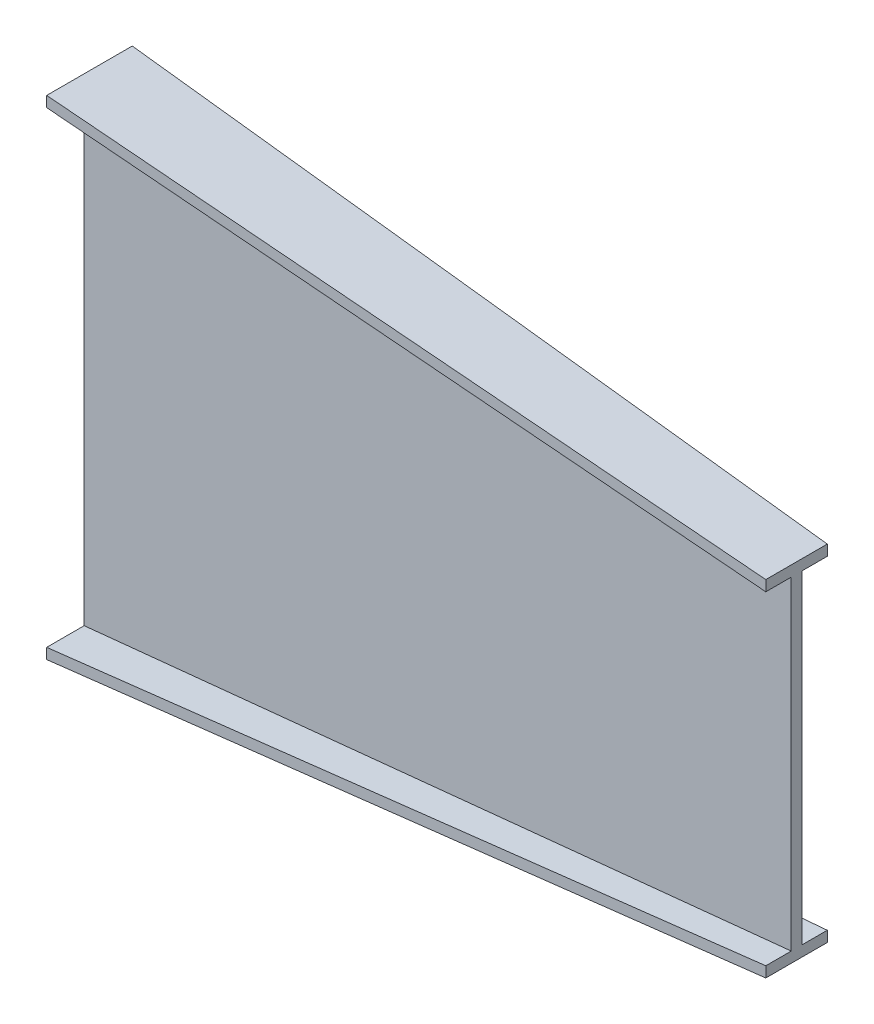
ISO-10303-21;
HEADER;
FILE_DESCRIPTION(('STEP AP214'),'2;1');
FILE_NAME('part.step','',(''),(''),'','','');
FILE_SCHEMA(('AUTOMOTIVE_DESIGN { 1 0 10303 214 1 1 1 1 }'));
ENDSEC;
DATA;
#1=APPLICATION_CONTEXT('core data for automotive mechanical design processes');
#2=APPLICATION_PROTOCOL_DEFINITION('international standard','automotive_design',2000,#1);
#3=PRODUCT_CONTEXT('',#1,'mechanical');
#4=PRODUCT('Part','Part','',(#3));
#5=PRODUCT_RELATED_PRODUCT_CATEGORY('part','',(#4));
#6=PRODUCT_DEFINITION_FORMATION('','',#4);
#7=PRODUCT_DEFINITION_CONTEXT('part definition',#1,'design');
#8=PRODUCT_DEFINITION('design','',#6,#7);
#9=PRODUCT_DEFINITION_SHAPE('','',#8);
#10=(LENGTH_UNIT() NAMED_UNIT(*) SI_UNIT(.MILLI.,.METRE.));
#11=(NAMED_UNIT(*) PLANE_ANGLE_UNIT() SI_UNIT($,.RADIAN.));
#12=(NAMED_UNIT(*) SI_UNIT($,.STERADIAN.) SOLID_ANGLE_UNIT());
#13=UNCERTAINTY_MEASURE_WITH_UNIT(LENGTH_MEASURE(1.E-05),#10,'distance_accuracy_value','');
#14=(GEOMETRIC_REPRESENTATION_CONTEXT(3) GLOBAL_UNCERTAINTY_ASSIGNED_CONTEXT((#13)) GLOBAL_UNIT_ASSIGNED_CONTEXT((#10,
#11,#12)) REPRESENTATION_CONTEXT('',''));
#15=CARTESIAN_POINT('',(0.,0.,0.));
#16=DIRECTION('',(0.,0.,1.));
#17=DIRECTION('',(1.,0.,0.));
#18=AXIS2_PLACEMENT_3D('',#15,#16,#17);
#19=CARTESIAN_POINT('',(1000.,0.,0.));
#20=DIRECTION('',(-1.,0.,0.));
#21=DIRECTION('',(0.,0.,1.));
#22=AXIS2_PLACEMENT_3D('',#19,#20,#21);
#23=PLANE('',#22);
#24=DIRECTION('',(0.,-1.,0.));
#25=VECTOR('',#24,1.);
#26=CARTESIAN_POINT('',(1000.,244.,-35.9999999999997));
#27=LINE('',#26,#25);
#28=CARTESIAN_POINT('',(1000.,244.,-35.9999999999997));
#29=VERTEX_POINT('',#28);
#30=CARTESIAN_POINT('',(1000.,229.,-35.9999999999997));
#31=VERTEX_POINT('',#30);
#32=EDGE_CURVE('E375',#29,#31,#27,.T.);
#33=ORIENTED_EDGE('',*,*,#32,.F.);
#34=DIRECTION('',(0.,0.,-1.));
#35=VECTOR('',#34,1.);
#36=CARTESIAN_POINT('',(1000.,244.,-35.9999999999997));
#37=LINE('',#36,#35);
#38=CARTESIAN_POINT('',(1000.,244.,51.0000000000004));
#39=VERTEX_POINT('',#38);
#40=EDGE_CURVE('E12',#39,#29,#37,.T.);
#41=ORIENTED_EDGE('',*,*,#40,.F.);
#42=DIRECTION('',(0.,1.,0.));
#43=VECTOR('',#42,1.);
#44=CARTESIAN_POINT('',(1000.,244.,51.0000000000004));
#45=LINE('',#44,#43);
#46=CARTESIAN_POINT('',(1000.,229.,51.0000000000004));
#47=VERTEX_POINT('',#46);
#48=EDGE_CURVE('E69',#47,#39,#45,.T.);
#49=ORIENTED_EDGE('',*,*,#48,.F.);
#50=DIRECTION('',(0.,0.,1.));
#51=VECTOR('',#50,1.);
#52=CARTESIAN_POINT('',(1000.,229.,15.0000000000003));
#53=LINE('',#52,#51);
#54=CARTESIAN_POINT('',(1000.,229.,15.0000000000003));
#55=VERTEX_POINT('',#54);
#56=EDGE_CURVE('E650',#55,#47,#53,.T.);
#57=ORIENTED_EDGE('',*,*,#56,.F.);
#58=DIRECTION('',(0.,1.,0.));
#59=VECTOR('',#58,1.);
#60=CARTESIAN_POINT('',(1000.,229.,15.0000000000003));
#61=LINE('',#60,#59);
#62=CARTESIAN_POINT('',(1000.,-229.,15.0000000000003));
#63=VERTEX_POINT('',#62);
#64=EDGE_CURVE('E412',#63,#55,#61,.T.);
#65=ORIENTED_EDGE('',*,*,#64,.F.);
#66=DIRECTION('',(0.,0.,-1.));
#67=VECTOR('',#66,1.);
#68=CARTESIAN_POINT('',(1000.,-229.,15.0000000000003));
#69=LINE('',#68,#67);
#70=CARTESIAN_POINT('',(1000.,-229.,51.0000000000002));
#71=VERTEX_POINT('',#70);
#72=EDGE_CURVE('E426',#71,#63,#69,.T.);
#73=ORIENTED_EDGE('',*,*,#72,.F.);
#74=DIRECTION('',(0.,1.,0.));
#75=VECTOR('',#74,1.);
#76=CARTESIAN_POINT('',(1000.,-229.,51.0000000000002));
#77=LINE('',#76,#75);
#78=CARTESIAN_POINT('',(1000.,-244.,51.0000000000004));
#79=VERTEX_POINT('',#78);
#80=EDGE_CURVE('E440',#79,#71,#77,.T.);
#81=ORIENTED_EDGE('',*,*,#80,.F.);
#82=DIRECTION('',(0.,0.,1.));
#83=VECTOR('',#82,1.);
#84=CARTESIAN_POINT('',(1000.,-244.,-35.9999999999997));
#85=LINE('',#84,#83);
#86=CARTESIAN_POINT('',(1000.,-244.,-35.9999999999997));
#87=VERTEX_POINT('',#86);
#88=EDGE_CURVE('E621',#87,#79,#85,.T.);
#89=ORIENTED_EDGE('',*,*,#88,.F.);
#90=DIRECTION('',(0.,-1.,0.));
#91=VECTOR('',#90,1.);
#92=CARTESIAN_POINT('',(1000.,-229.,-35.9999999999997));
#93=LINE('',#92,#91);
#94=CARTESIAN_POINT('',(1000.,-229.,-35.9999999999997));
#95=VERTEX_POINT('',#94);
#96=EDGE_CURVE('E613',#95,#87,#93,.T.);
#97=ORIENTED_EDGE('',*,*,#96,.F.);
#98=DIRECTION('',(0.,0.,-1.));
#99=VECTOR('',#98,1.);
#100=CARTESIAN_POINT('',(1000.,-229.,-35.9999999999997));
#101=LINE('',#100,#99);
#102=CARTESIAN_POINT('',(1000.,-229.,4.44089209850063E-13));
#103=VERTEX_POINT('',#102);
#104=EDGE_CURVE('E528',#103,#95,#101,.T.);
#105=ORIENTED_EDGE('',*,*,#104,.F.);
#106=DIRECTION('',(0.,-1.,0.));
#107=VECTOR('',#106,1.);
#108=CARTESIAN_POINT('',(1000.,229.,4.44089209850063E-13));
#109=LINE('',#108,#107);
#110=CARTESIAN_POINT('',(1000.,229.,4.44089209850063E-13));
#111=VERTEX_POINT('',#110);
#112=EDGE_CURVE('E83',#111,#103,#109,.T.);
#113=ORIENTED_EDGE('',*,*,#112,.F.);
#114=DIRECTION('',(0.,0.,1.));
#115=VECTOR('',#114,1.);
#116=CARTESIAN_POINT('',(1000.,229.,-35.9999999999997));
#117=LINE('',#116,#115);
#118=EDGE_CURVE('E77',#31,#111,#117,.T.);
#119=ORIENTED_EDGE('',*,*,#118,.F.);
#120=EDGE_LOOP('',(#33,#41,#49,#57,#65,#73,#81,#89,#97,#105,#113,#119));
#121=FACE_BOUND('',#120,.T.);
#122=ADVANCED_FACE('F59',(#121),#23,.F.);
#123=CARTESIAN_POINT('',(0.,0.,0.));
#124=DIRECTION('',(1.,0.,0.));
#125=DIRECTION('',(0.,0.,-1.));
#126=AXIS2_PLACEMENT_3D('',#123,#124,#125);
#127=PLANE('',#126);
#128=DIRECTION('',(0.,-1.,0.));
#129=VECTOR('',#128,1.);
#130=CARTESIAN_POINT('',(0.,345.5,68.0000000000003));
#131=LINE('',#130,#129);
#132=CARTESIAN_POINT('',(0.,345.5,68.0000000000003));
#133=VERTEX_POINT('',#132);
#134=CARTESIAN_POINT('',(0.,330.5,68.0000000000003));
#135=VERTEX_POINT('',#134);
#136=EDGE_CURVE('E158',#133,#135,#131,.T.);
#137=ORIENTED_EDGE('',*,*,#136,.F.);
#138=DIRECTION('',(0.,0.,1.));
#139=VECTOR('',#138,1.);
#140=CARTESIAN_POINT('',(0.,345.5,68.0000000000003));
#141=LINE('',#140,#139);
#142=CARTESIAN_POINT('',(0.,345.5,-52.9999999999997));
#143=VERTEX_POINT('',#142);
#144=EDGE_CURVE('E167',#143,#133,#141,.T.);
#145=ORIENTED_EDGE('',*,*,#144,.F.);
#146=DIRECTION('',(0.,1.,0.));
#147=VECTOR('',#146,1.);
#148=CARTESIAN_POINT('',(0.,345.5,-52.9999999999997));
#149=LINE('',#148,#147);
#150=CARTESIAN_POINT('',(0.,330.5,-52.9999999999997));
#151=VERTEX_POINT('',#150);
#152=EDGE_CURVE('E174',#151,#143,#149,.T.);
#153=ORIENTED_EDGE('',*,*,#152,.F.);
#154=DIRECTION('',(0.,0.,-1.));
#155=VECTOR('',#154,1.);
#156=CARTESIAN_POINT('',(0.,330.5,3.17913927887659E-13));
#157=LINE('',#156,#155);
#158=CARTESIAN_POINT('',(0.,330.5,3.17913927887659E-13));
#159=VERTEX_POINT('',#158);
#160=EDGE_CURVE('E298',#159,#151,#157,.T.);
#161=ORIENTED_EDGE('',*,*,#160,.F.);
#162=DIRECTION('',(0.,1.,0.));
#163=VECTOR('',#162,1.);
#164=CARTESIAN_POINT('',(0.,330.5,3.17913927887659E-13));
#165=LINE('',#164,#163);
#166=CARTESIAN_POINT('',(0.,-330.5,3.17913927887659E-13));
#167=VERTEX_POINT('',#166);
#168=EDGE_CURVE('E294',#167,#159,#165,.T.);
#169=ORIENTED_EDGE('',*,*,#168,.F.);
#170=DIRECTION('',(0.,0.,1.));
#171=VECTOR('',#170,1.);
#172=CARTESIAN_POINT('',(0.,-330.5,3.17913927887659E-13));
#173=LINE('',#172,#171);
#174=CARTESIAN_POINT('',(0.,-330.5,-52.9999999999999));
#175=VERTEX_POINT('',#174);
#176=EDGE_CURVE('E290',#175,#167,#173,.T.);
#177=ORIENTED_EDGE('',*,*,#176,.F.);
#178=DIRECTION('',(0.,1.,0.));
#179=VECTOR('',#178,1.);
#180=CARTESIAN_POINT('',(0.,-330.5,-52.9999999999999));
#181=LINE('',#180,#179);
#182=CARTESIAN_POINT('',(0.,-345.5,-52.9999999999999));
#183=VERTEX_POINT('',#182);
#184=EDGE_CURVE('E286',#183,#175,#181,.T.);
#185=ORIENTED_EDGE('',*,*,#184,.F.);
#186=DIRECTION('',(0.,0.,-1.));
#187=VECTOR('',#186,1.);
#188=CARTESIAN_POINT('',(0.,-345.5,68.0000000000001));
#189=LINE('',#188,#187);
#190=CARTESIAN_POINT('',(0.,-345.5,68.0000000000001));
#191=VERTEX_POINT('',#190);
#192=EDGE_CURVE('E282',#191,#183,#189,.T.);
#193=ORIENTED_EDGE('',*,*,#192,.F.);
#194=DIRECTION('',(0.,-1.,0.));
#195=VECTOR('',#194,1.);
#196=CARTESIAN_POINT('',(0.,-330.5,68.0000000000001));
#197=LINE('',#196,#195);
#198=CARTESIAN_POINT('',(0.,-330.5,68.0000000000001));
#199=VERTEX_POINT('',#198);
#200=EDGE_CURVE('E278',#199,#191,#197,.T.);
#201=ORIENTED_EDGE('',*,*,#200,.F.);
#202=DIRECTION('',(0.,0.,1.));
#203=VECTOR('',#202,1.);
#204=CARTESIAN_POINT('',(0.,-330.5,68.0000000000001));
#205=LINE('',#204,#203);
#206=CARTESIAN_POINT('',(0.,-330.5,15.0000000000003));
#207=VERTEX_POINT('',#206);
#208=EDGE_CURVE('E273',#207,#199,#205,.T.);
#209=ORIENTED_EDGE('',*,*,#208,.F.);
#210=DIRECTION('',(0.,-1.,0.));
#211=VECTOR('',#210,1.);
#212=CARTESIAN_POINT('',(0.,330.5,15.0000000000003));
#213=LINE('',#212,#211);
#214=CARTESIAN_POINT('',(0.,330.5,15.0000000000003));
#215=VERTEX_POINT('',#214);
#216=EDGE_CURVE('E271',#215,#207,#213,.T.);
#217=ORIENTED_EDGE('',*,*,#216,.F.);
#218=DIRECTION('',(0.,0.,-1.));
#219=VECTOR('',#218,1.);
#220=CARTESIAN_POINT('',(0.,330.5,68.0000000000003));
#221=LINE('',#220,#219);
#222=EDGE_CURVE('E180',#135,#215,#221,.T.);
#223=ORIENTED_EDGE('',*,*,#222,.F.);
#224=EDGE_LOOP('',(#137,#145,#153,#161,#169,#177,#185,#193,#201,#209,#217,#223));
#225=FACE_BOUND('',#224,.T.);
#226=ADVANCED_FACE('F178',(#225),#127,.F.);
#227=CARTESIAN_POINT('',(0.,0.,15.0000000000003));
#228=DIRECTION('',(0.,0.,1.));
#229=DIRECTION('',(1.,0.,0.));
#230=AXIS2_PLACEMENT_3D('',#227,#228,#229);
#231=PLANE('',#230);
#232=DIRECTION('',(0.994888337484089,0.100981166254635,0.));
#233=VECTOR('',#232,1.);
#234=CARTESIAN_POINT('',(0.,-330.5,15.0000000000003));
#235=LINE('',#234,#233);
#236=EDGE_CURVE('E173',#207,#63,#235,.T.);
#237=ORIENTED_EDGE('',*,*,#236,.T.);
#238=ORIENTED_EDGE('',*,*,#64,.T.);
#239=DIRECTION('',(0.994888337484089,-0.100981166254635,0.));
#240=VECTOR('',#239,1.);
#241=CARTESIAN_POINT('',(0.,330.5,15.0000000000003));
#242=LINE('',#241,#240);
#243=EDGE_CURVE('E385',#215,#55,#242,.T.);
#244=ORIENTED_EDGE('',*,*,#243,.F.);
#245=ORIENTED_EDGE('',*,*,#216,.T.);
#246=EDGE_LOOP('',(#237,#238,#244,#245));
#247=FACE_BOUND('',#246,.T.);
#248=ADVANCED_FACE('F201',(#247),#231,.T.);
#249=CARTESIAN_POINT('',(33.2036774143579,327.129826742443,0.));
#250=DIRECTION('',(-0.100981166254635,-0.994888337484089,0.));
#251=DIRECTION('',(0.994888337484089,-0.100981166254635,0.));
#252=AXIS2_PLACEMENT_3D('',#249,#250,#251);
#253=PLANE('',#252);
#254=ORIENTED_EDGE('',*,*,#243,.T.);
#255=ORIENTED_EDGE('',*,*,#56,.T.);
#256=DIRECTION('',(0.994746072602873,-0.100966726369192,-0.0169106832342488));
#257=VECTOR('',#256,1.);
#258=CARTESIAN_POINT('',(0.,330.5,68.0000000000003));
#259=LINE('',#258,#257);
#260=EDGE_CURVE('E163',#135,#47,#259,.T.);
#261=ORIENTED_EDGE('',*,*,#260,.F.);
#262=ORIENTED_EDGE('',*,*,#222,.T.);
#263=EDGE_LOOP('',(#254,#255,#261,#262));
#264=FACE_BOUND('',#263,.T.);
#265=ADVANCED_FACE('F387',(#264),#253,.T.);
#266=CARTESIAN_POINT('',(33.2036774143579,-327.129826742443,2.52213240063264E-13));
#267=DIRECTION('',(-0.100981166254635,0.994888337484089,0.));
#268=DIRECTION('',(-0.994888337484089,-0.100981166254635,0.));
#269=AXIS2_PLACEMENT_3D('',#266,#267,#268);
#270=PLANE('',#269);
#271=DIRECTION('',(0.994746072602873,0.100966726369192,-0.0169106832342488));
#272=VECTOR('',#271,1.);
#273=CARTESIAN_POINT('',(0.,-330.5,68.0000000000001));
#274=LINE('',#273,#272);
#275=EDGE_CURVE('E473',#199,#71,#274,.T.);
#276=ORIENTED_EDGE('',*,*,#275,.T.);
#277=ORIENTED_EDGE('',*,*,#72,.T.);
#278=ORIENTED_EDGE('',*,*,#236,.F.);
#279=ORIENTED_EDGE('',*,*,#208,.T.);
#280=EDGE_LOOP('',(#276,#277,#278,#279));
#281=FACE_BOUND('',#280,.T.);
#282=ADVANCED_FACE('F396',(#281),#270,.T.);
#283=CARTESIAN_POINT('',(1.15566601252218,1.00631138500313E-12,67.9803536777821));
#284=DIRECTION('',(0.0169975440323164,0.,0.999855531312834));
#285=DIRECTION('',(0.999855531312834,0.,-0.0169975440323164));
#286=AXIS2_PLACEMENT_3D('',#283,#284,#285);
#287=PLANE('',#286);
#288=DIRECTION('',(0.994746072602873,0.100966726369192,-0.0169106832342486));
#289=VECTOR('',#288,1.);
#290=CARTESIAN_POINT('',(0.,-345.5,68.0000000000001));
#291=LINE('',#290,#289);
#292=EDGE_CURVE('E465',#191,#79,#291,.T.);
#293=ORIENTED_EDGE('',*,*,#292,.T.);
#294=ORIENTED_EDGE('',*,*,#80,.T.);
#295=ORIENTED_EDGE('',*,*,#275,.F.);
#296=ORIENTED_EDGE('',*,*,#200,.T.);
#297=EDGE_LOOP('',(#293,#294,#295,#296));
#298=FACE_BOUND('',#297,.T.);
#299=ADVANCED_FACE('F446',(#298),#287,.T.);
#300=CARTESIAN_POINT('',(34.7106521835421,-341.97686880337,0.));
#301=DIRECTION('',(0.100981166254635,-0.994888337484089,0.));
#302=DIRECTION('',(0.994888337484089,0.100981166254635,0.));
#303=AXIS2_PLACEMENT_3D('',#300,#301,#302);
#304=PLANE('',#303);
#305=DIRECTION('',(0.994746072602873,0.100966726369192,0.016910683234249));
#306=VECTOR('',#305,1.);
#307=CARTESIAN_POINT('',(0.,-345.5,-52.9999999999999));
#308=LINE('',#307,#306);
#309=EDGE_CURVE('E472',#183,#87,#308,.T.);
#310=ORIENTED_EDGE('',*,*,#309,.T.);
#311=ORIENTED_EDGE('',*,*,#88,.T.);
#312=ORIENTED_EDGE('',*,*,#292,.F.);
#313=ORIENTED_EDGE('',*,*,#192,.T.);
#314=EDGE_LOOP('',(#310,#311,#312,#313));
#315=FACE_BOUND('',#314,.T.);
#316=ADVANCED_FACE('F455',(#315),#304,.T.);
#317=CARTESIAN_POINT('',(0.900739686230685,0.,-52.9846874253339));
#318=DIRECTION('',(0.0169975440323183,0.,-0.999855531312834));
#319=DIRECTION('',(-0.999855531312834,0.,-0.0169975440323183));
#320=AXIS2_PLACEMENT_3D('',#317,#318,#319);
#321=PLANE('',#320);
#322=DIRECTION('',(0.994746072602873,0.100966726369191,0.016910683234249));
#323=VECTOR('',#322,1.);
#324=CARTESIAN_POINT('',(0.,-330.5,-52.9999999999999));
#325=LINE('',#324,#323);
#326=EDGE_CURVE('E490',#175,#95,#325,.T.);
#327=ORIENTED_EDGE('',*,*,#326,.T.);
#328=ORIENTED_EDGE('',*,*,#96,.T.);
#329=ORIENTED_EDGE('',*,*,#309,.F.);
#330=ORIENTED_EDGE('',*,*,#184,.T.);
#331=EDGE_LOOP('',(#327,#328,#329,#330));
#332=FACE_BOUND('',#331,.T.);
#333=ADVANCED_FACE('F501',(#332),#321,.T.);
#334=CARTESIAN_POINT('',(33.2036774143579,-327.129826742443,0.));
#335=DIRECTION('',(-0.100981166254635,0.994888337484089,0.));
#336=DIRECTION('',(-0.994888337484089,-0.100981166254635,0.));
#337=AXIS2_PLACEMENT_3D('',#334,#335,#336);
#338=PLANE('',#337);
#339=DIRECTION('',(0.994888337484089,0.100981166254635,0.));
#340=VECTOR('',#339,1.);
#341=CARTESIAN_POINT('',(0.,-330.5,3.17913927887659E-13));
#342=LINE('',#341,#340);
#343=EDGE_CURVE('E567',#167,#103,#342,.T.);
#344=ORIENTED_EDGE('',*,*,#343,.T.);
#345=ORIENTED_EDGE('',*,*,#104,.T.);
#346=ORIENTED_EDGE('',*,*,#326,.F.);
#347=ORIENTED_EDGE('',*,*,#176,.T.);
#348=EDGE_LOOP('',(#344,#345,#346,#347));
#349=FACE_BOUND('',#348,.T.);
#350=ADVANCED_FACE('F510',(#349),#338,.T.);
#351=CARTESIAN_POINT('',(0.,0.,3.17913927887659E-13));
#352=DIRECTION('',(0.,0.,-1.));
#353=DIRECTION('',(-1.,0.,0.));
#354=AXIS2_PLACEMENT_3D('',#351,#352,#353);
#355=PLANE('',#354);
#356=DIRECTION('',(0.994888337484089,-0.100981166254635,0.));
#357=VECTOR('',#356,1.);
#358=CARTESIAN_POINT('',(0.,330.5,3.17913927887659E-13));
#359=LINE('',#358,#357);
#360=EDGE_CURVE('E559',#159,#111,#359,.T.);
#361=ORIENTED_EDGE('',*,*,#360,.T.);
#362=ORIENTED_EDGE('',*,*,#112,.T.);
#363=ORIENTED_EDGE('',*,*,#343,.F.);
#364=ORIENTED_EDGE('',*,*,#168,.T.);
#365=EDGE_LOOP('',(#361,#362,#363,#364));
#366=FACE_BOUND('',#365,.T.);
#367=ADVANCED_FACE('F544',(#366),#355,.T.);
#368=CARTESIAN_POINT('',(33.2036774143579,327.129826742443,0.));
#369=DIRECTION('',(-0.100981166254635,-0.994888337484089,0.));
#370=DIRECTION('',(0.994888337484089,-0.100981166254635,0.));
#371=AXIS2_PLACEMENT_3D('',#368,#369,#370);
#372=PLANE('',#371);
#373=DIRECTION('',(0.994746072602873,-0.100966726369192,0.0169106832342488));
#374=VECTOR('',#373,1.);
#375=CARTESIAN_POINT('',(0.,330.5,-52.9999999999997));
#376=LINE('',#375,#374);
#377=EDGE_CURVE('E566',#151,#31,#376,.T.);
#378=ORIENTED_EDGE('',*,*,#377,.T.);
#379=ORIENTED_EDGE('',*,*,#118,.T.);
#380=ORIENTED_EDGE('',*,*,#360,.F.);
#381=ORIENTED_EDGE('',*,*,#160,.T.);
#382=EDGE_LOOP('',(#378,#379,#380,#381));
#383=FACE_BOUND('',#382,.T.);
#384=ADVANCED_FACE('F325',(#383),#372,.T.);
#385=CARTESIAN_POINT('',(0.900739686230672,0.,-52.9846874253338));
#386=DIRECTION('',(0.0169975440323182,0.,-0.999855531312834));
#387=DIRECTION('',(-0.999855531312834,0.,-0.0169975440323182));
#388=AXIS2_PLACEMENT_3D('',#385,#386,#387);
#389=PLANE('',#388);
#390=DIRECTION('',(0.994746072602873,-0.100966726369192,0.0169106832342488));
#391=VECTOR('',#390,1.);
#392=CARTESIAN_POINT('',(0.,345.5,-52.9999999999997));
#393=LINE('',#392,#391);
#394=EDGE_CURVE('E164',#143,#29,#393,.T.);
#395=ORIENTED_EDGE('',*,*,#394,.T.);
#396=ORIENTED_EDGE('',*,*,#32,.T.);
#397=ORIENTED_EDGE('',*,*,#377,.F.);
#398=ORIENTED_EDGE('',*,*,#152,.T.);
#399=EDGE_LOOP('',(#395,#396,#397,#398));
#400=FACE_BOUND('',#399,.T.);
#401=ADVANCED_FACE('F315',(#400),#389,.T.);
#402=CARTESIAN_POINT('',(34.7106521835421,341.97686880337,0.));
#403=DIRECTION('',(0.100981166254635,0.994888337484089,0.));
#404=DIRECTION('',(-0.994888337484089,0.100981166254635,0.));
#405=AXIS2_PLACEMENT_3D('',#402,#403,#404);
#406=PLANE('',#405);
#407=DIRECTION('',(0.994746072602873,-0.100966726369192,-0.0169106832342488));
#408=VECTOR('',#407,1.);
#409=CARTESIAN_POINT('',(0.,345.5,68.0000000000003));
#410=LINE('',#409,#408);
#411=EDGE_CURVE('E153',#133,#39,#410,.T.);
#412=ORIENTED_EDGE('',*,*,#411,.T.);
#413=ORIENTED_EDGE('',*,*,#40,.T.);
#414=ORIENTED_EDGE('',*,*,#394,.F.);
#415=ORIENTED_EDGE('',*,*,#144,.T.);
#416=EDGE_LOOP('',(#412,#413,#414,#415));
#417=FACE_BOUND('',#416,.T.);
#418=ADVANCED_FACE('F169',(#417),#406,.T.);
#419=CARTESIAN_POINT('',(1.15566601252238,0.,67.9803536777874));
#420=DIRECTION('',(0.0169975440323181,0.,0.999855531312834));
#421=DIRECTION('',(0.999855531312834,0.,-0.0169975440323181));
#422=AXIS2_PLACEMENT_3D('',#419,#420,#421);
#423=PLANE('',#422);
#424=ORIENTED_EDGE('',*,*,#260,.T.);
#425=ORIENTED_EDGE('',*,*,#48,.T.);
#426=ORIENTED_EDGE('',*,*,#411,.F.);
#427=ORIENTED_EDGE('',*,*,#136,.T.);
#428=EDGE_LOOP('',(#424,#425,#426,#427));
#429=FACE_BOUND('',#428,.T.);
#430=ADVANCED_FACE('F156',(#429),#423,.T.);
#431=CLOSED_SHELL('',(#122,#226,#248,#265,#282,#299,#316,#333,#350,#367,#384,#401,#418,#430));
#432=MANIFOLD_SOLID_BREP('B2',#431);
#433=ADVANCED_BREP_SHAPE_REPRESENTATION('',(#18,#432),#14);
#434=SHAPE_DEFINITION_REPRESENTATION(#9,#433);
ENDSEC;
END-ISO-10303-21;
